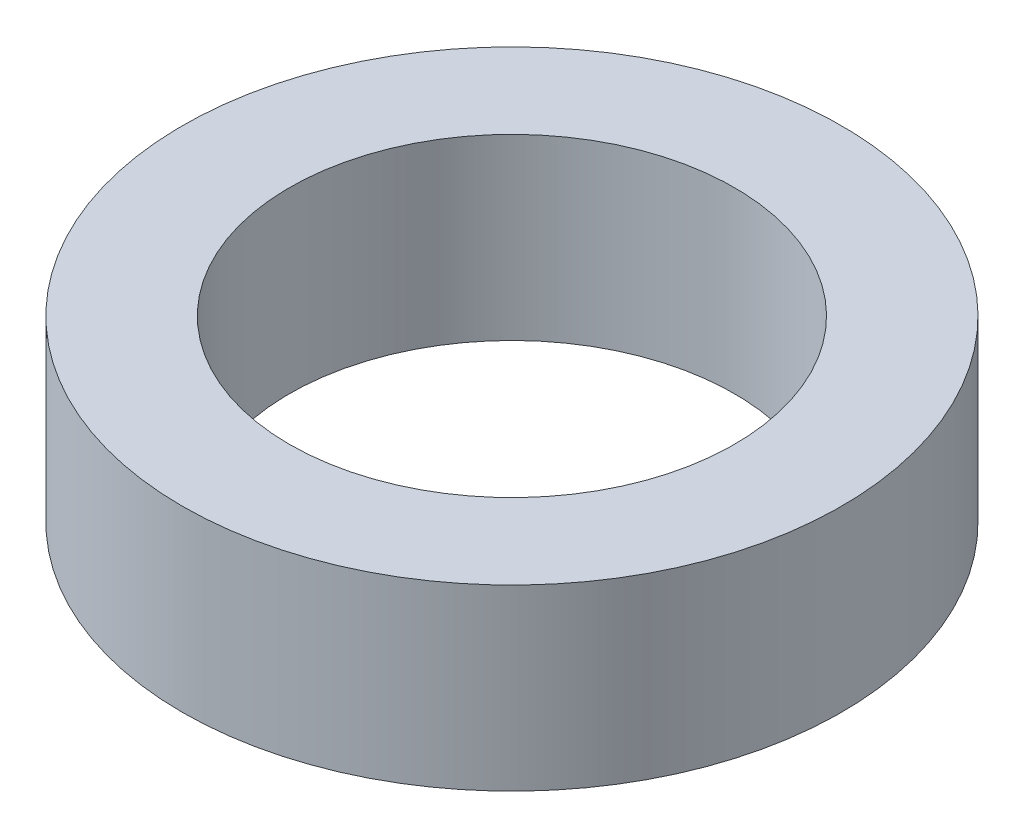
ISO-10303-21;
HEADER;
FILE_DESCRIPTION(('STEP AP214'),'2;1');
FILE_NAME('part.step','',(''),(''),'','','');
FILE_SCHEMA(('AUTOMOTIVE_DESIGN { 1 0 10303 214 1 1 1 1 }'));
ENDSEC;
DATA;
#1=APPLICATION_CONTEXT('core data for automotive mechanical design processes');
#2=APPLICATION_PROTOCOL_DEFINITION('international standard','automotive_design',2000,#1);
#3=PRODUCT_CONTEXT('',#1,'mechanical');
#4=PRODUCT('Part','Part','',(#3));
#5=PRODUCT_RELATED_PRODUCT_CATEGORY('part','',(#4));
#6=PRODUCT_DEFINITION_FORMATION('','',#4);
#7=PRODUCT_DEFINITION_CONTEXT('part definition',#1,'design');
#8=PRODUCT_DEFINITION('design','',#6,#7);
#9=PRODUCT_DEFINITION_SHAPE('','',#8);
#10=(LENGTH_UNIT() NAMED_UNIT(*) SI_UNIT(.MILLI.,.METRE.));
#11=(NAMED_UNIT(*) PLANE_ANGLE_UNIT() SI_UNIT($,.RADIAN.));
#12=(NAMED_UNIT(*) SI_UNIT($,.STERADIAN.) SOLID_ANGLE_UNIT());
#13=UNCERTAINTY_MEASURE_WITH_UNIT(LENGTH_MEASURE(1.E-05),#10,'distance_accuracy_value','');
#14=(GEOMETRIC_REPRESENTATION_CONTEXT(3) GLOBAL_UNCERTAINTY_ASSIGNED_CONTEXT((#13)) GLOBAL_UNIT_ASSIGNED_CONTEXT((#10,
#11,#12)) REPRESENTATION_CONTEXT('',''));
#15=CARTESIAN_POINT('',(0.,0.,0.));
#16=DIRECTION('',(0.,0.,1.));
#17=DIRECTION('',(1.,0.,0.));
#18=AXIS2_PLACEMENT_3D('',#15,#16,#17);
#19=CARTESIAN_POINT('',(0.,3.25,0.));
#20=DIRECTION('',(0.,1.,0.));
#21=DIRECTION('',(0.,0.,1.));
#22=AXIS2_PLACEMENT_3D('',#19,#20,#21);
#23=PLANE('',#22);
#24=CARTESIAN_POINT('',(0.,3.25,0.));
#25=DIRECTION('',(0.,1.,0.));
#26=DIRECTION('',(0.,0.,1.));
#27=AXIS2_PLACEMENT_3D('',#24,#25,#26);
#28=CIRCLE('',#27,6.);
#29=CARTESIAN_POINT('',(0.,3.25,6.));
#30=VERTEX_POINT('',#29);
#31=EDGE_CURVE('E10',#30,#30,#28,.T.);
#32=ORIENTED_EDGE('',*,*,#31,.T.);
#33=EDGE_LOOP('',(#32));
#34=FACE_BOUND('',#33,.T.);
#35=CARTESIAN_POINT('',(0.,3.25,0.));
#36=DIRECTION('',(0.,1.,0.));
#37=DIRECTION('',(0.,0.,1.));
#38=AXIS2_PLACEMENT_3D('',#35,#36,#37);
#39=CIRCLE('',#38,4.05);
#40=CARTESIAN_POINT('',(0.,3.25,4.05));
#41=VERTEX_POINT('',#40);
#42=EDGE_CURVE('E56',#41,#41,#39,.T.);
#43=ORIENTED_EDGE('',*,*,#42,.F.);
#44=EDGE_LOOP('',(#43));
#45=FACE_BOUND('',#44,.T.);
#46=ADVANCED_FACE('F43',(#34,#45),#23,.T.);
#47=CARTESIAN_POINT('',(0.,0.,0.));
#48=DIRECTION('',(0.,1.,0.));
#49=DIRECTION('',(0.,0.,1.));
#50=AXIS2_PLACEMENT_3D('',#47,#48,#49);
#51=PLANE('',#50);
#52=CARTESIAN_POINT('',(0.,0.,0.));
#53=DIRECTION('',(0.,1.,0.));
#54=DIRECTION('',(0.,0.,1.));
#55=AXIS2_PLACEMENT_3D('',#52,#53,#54);
#56=CIRCLE('',#55,6.);
#57=CARTESIAN_POINT('',(0.,0.,6.));
#58=VERTEX_POINT('',#57);
#59=EDGE_CURVE('E47',#58,#58,#56,.T.);
#60=ORIENTED_EDGE('',*,*,#59,.F.);
#61=EDGE_LOOP('',(#60));
#62=FACE_BOUND('',#61,.T.);
#63=CARTESIAN_POINT('',(0.,0.,0.));
#64=DIRECTION('',(0.,1.,0.));
#65=DIRECTION('',(0.,0.,1.));
#66=AXIS2_PLACEMENT_3D('',#63,#64,#65);
#67=CIRCLE('',#66,4.05);
#68=CARTESIAN_POINT('',(0.,0.,4.05));
#69=VERTEX_POINT('',#68);
#70=EDGE_CURVE('E58',#69,#69,#67,.T.);
#71=ORIENTED_EDGE('',*,*,#70,.T.);
#72=EDGE_LOOP('',(#71));
#73=FACE_BOUND('',#72,.T.);
#74=ADVANCED_FACE('F70',(#62,#73),#51,.F.);
#75=CARTESIAN_POINT('',(0.,3.25,0.));
#76=DIRECTION('',(0.,-1.,0.));
#77=DIRECTION('',(0.,0.,-1.));
#78=AXIS2_PLACEMENT_3D('',#75,#76,#77);
#79=CYLINDRICAL_SURFACE('',#78,6.);
#80=ORIENTED_EDGE('',*,*,#31,.F.);
#81=EDGE_LOOP('',(#80));
#82=FACE_BOUND('',#81,.T.);
#83=ORIENTED_EDGE('',*,*,#59,.T.);
#84=EDGE_LOOP('',(#83));
#85=FACE_BOUND('',#84,.T.);
#86=ADVANCED_FACE('F45',(#82,#85),#79,.T.);
#87=CARTESIAN_POINT('',(0.,3.25,0.));
#88=DIRECTION('',(0.,-1.,0.));
#89=DIRECTION('',(0.,0.,-1.));
#90=AXIS2_PLACEMENT_3D('',#87,#88,#89);
#91=CYLINDRICAL_SURFACE('',#90,4.05);
#92=ORIENTED_EDGE('',*,*,#42,.T.);
#93=EDGE_LOOP('',(#92));
#94=FACE_BOUND('',#93,.T.);
#95=ORIENTED_EDGE('',*,*,#70,.F.);
#96=EDGE_LOOP('',(#95));
#97=FACE_BOUND('',#96,.T.);
#98=ADVANCED_FACE('F66',(#94,#97),#91,.F.);
#99=CLOSED_SHELL('',(#46,#74,#86,#98));
#100=MANIFOLD_SOLID_BREP('B2',#99);
#101=ADVANCED_BREP_SHAPE_REPRESENTATION('',(#18,#100),#14);
#102=SHAPE_DEFINITION_REPRESENTATION(#9,#101);
ENDSEC;
END-ISO-10303-21;
